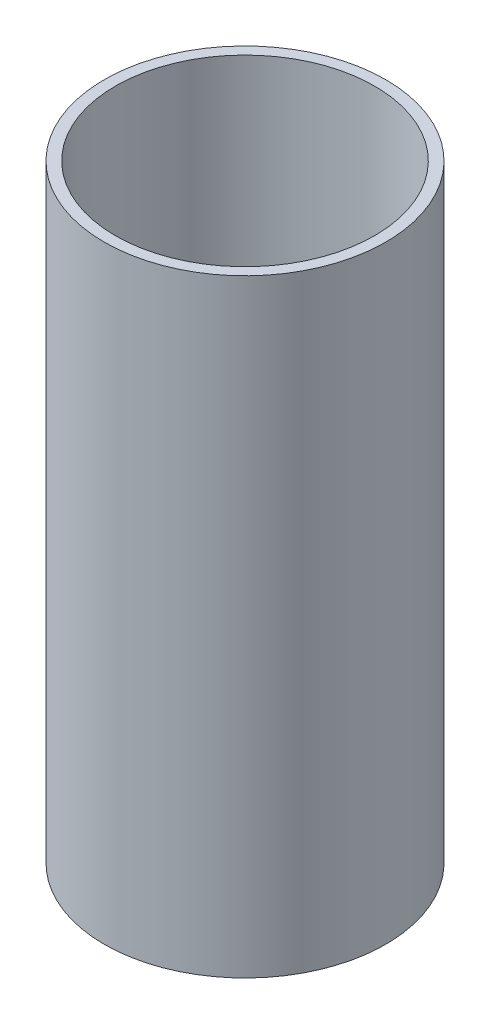
ISO-10303-21;
HEADER;
FILE_DESCRIPTION(('STEP AP214'),'2;1');
FILE_NAME('part.step','',(''),(''),'','','');
FILE_SCHEMA(('AUTOMOTIVE_DESIGN { 1 0 10303 214 1 1 1 1 }'));
ENDSEC;
DATA;
#1=APPLICATION_CONTEXT('core data for automotive mechanical design processes');
#2=APPLICATION_PROTOCOL_DEFINITION('international standard','automotive_design',2000,#1);
#3=PRODUCT_CONTEXT('',#1,'mechanical');
#4=PRODUCT('Part','Part','',(#3));
#5=PRODUCT_RELATED_PRODUCT_CATEGORY('part','',(#4));
#6=PRODUCT_DEFINITION_FORMATION('','',#4);
#7=PRODUCT_DEFINITION_CONTEXT('part definition',#1,'design');
#8=PRODUCT_DEFINITION('design','',#6,#7);
#9=PRODUCT_DEFINITION_SHAPE('','',#8);
#10=(LENGTH_UNIT() NAMED_UNIT(*) SI_UNIT(.MILLI.,.METRE.));
#11=(NAMED_UNIT(*) PLANE_ANGLE_UNIT() SI_UNIT($,.RADIAN.));
#12=(NAMED_UNIT(*) SI_UNIT($,.STERADIAN.) SOLID_ANGLE_UNIT());
#13=UNCERTAINTY_MEASURE_WITH_UNIT(LENGTH_MEASURE(1.E-05),#10,'distance_accuracy_value','');
#14=(GEOMETRIC_REPRESENTATION_CONTEXT(3) GLOBAL_UNCERTAINTY_ASSIGNED_CONTEXT((#13)) GLOBAL_UNIT_ASSIGNED_CONTEXT((#10,
#11,#12)) REPRESENTATION_CONTEXT('',''));
#15=CARTESIAN_POINT('',(0.,0.,0.));
#16=DIRECTION('',(0.,0.,1.));
#17=DIRECTION('',(1.,0.,0.));
#18=AXIS2_PLACEMENT_3D('',#15,#16,#17);
#19=CARTESIAN_POINT('',(0.,80.1,0.));
#20=DIRECTION('',(0.,1.,0.));
#21=DIRECTION('',(0.,0.,1.));
#22=AXIS2_PLACEMENT_3D('',#19,#20,#21);
#23=PLANE('',#22);
#24=CARTESIAN_POINT('',(0.,80.1,0.));
#25=DIRECTION('',(0.,1.,0.));
#26=DIRECTION('',(0.,0.,1.));
#27=AXIS2_PLACEMENT_3D('',#24,#25,#26);
#28=CIRCLE('',#27,19.);
#29=CARTESIAN_POINT('',(0.,80.1,19.));
#30=VERTEX_POINT('',#29);
#31=EDGE_CURVE('E10',#30,#30,#28,.T.);
#32=ORIENTED_EDGE('',*,*,#31,.T.);
#33=EDGE_LOOP('',(#32));
#34=FACE_BOUND('',#33,.T.);
#35=CARTESIAN_POINT('',(0.,80.1,0.));
#36=DIRECTION('',(0.,1.,0.));
#37=DIRECTION('',(0.,0.,1.));
#38=AXIS2_PLACEMENT_3D('',#35,#36,#37);
#39=CIRCLE('',#38,17.5);
#40=CARTESIAN_POINT('',(0.,80.1,17.5));
#41=VERTEX_POINT('',#40);
#42=EDGE_CURVE('E44',#41,#41,#39,.T.);
#43=ORIENTED_EDGE('',*,*,#42,.F.);
#44=EDGE_LOOP('',(#43));
#45=FACE_BOUND('',#44,.T.);
#46=ADVANCED_FACE('F37',(#34,#45),#23,.T.);
#47=CARTESIAN_POINT('',(0.,80.1,0.));
#48=DIRECTION('',(0.,-1.,0.));
#49=DIRECTION('',(0.,0.,-1.));
#50=AXIS2_PLACEMENT_3D('',#47,#48,#49);
#51=CYLINDRICAL_SURFACE('',#50,19.);
#52=ORIENTED_EDGE('',*,*,#31,.F.);
#53=EDGE_LOOP('',(#52));
#54=FACE_BOUND('',#53,.T.);
#55=CARTESIAN_POINT('',(0.,-2.,0.));
#56=DIRECTION('',(0.,1.,0.));
#57=DIRECTION('',(0.,0.,1.));
#58=AXIS2_PLACEMENT_3D('',#55,#56,#57);
#59=CIRCLE('',#58,19.);
#60=CARTESIAN_POINT('',(0.,-2.,19.));
#61=VERTEX_POINT('',#60);
#62=EDGE_CURVE('E53',#61,#61,#59,.T.);
#63=ORIENTED_EDGE('',*,*,#62,.T.);
#64=EDGE_LOOP('',(#63));
#65=FACE_BOUND('',#64,.T.);
#66=ADVANCED_FACE('F39',(#54,#65),#51,.T.);
#67=CARTESIAN_POINT('',(0.,80.1,0.));
#68=DIRECTION('',(0.,-1.,0.));
#69=DIRECTION('',(0.,0.,-1.));
#70=AXIS2_PLACEMENT_3D('',#67,#68,#69);
#71=CYLINDRICAL_SURFACE('',#70,17.5);
#72=ORIENTED_EDGE('',*,*,#42,.T.);
#73=EDGE_LOOP('',(#72));
#74=FACE_BOUND('',#73,.T.);
#75=CARTESIAN_POINT('',(0.,0.,0.));
#76=DIRECTION('',(0.,1.,0.));
#77=DIRECTION('',(0.,0.,1.));
#78=AXIS2_PLACEMENT_3D('',#75,#76,#77);
#79=CIRCLE('',#78,17.5);
#80=CARTESIAN_POINT('',(0.,0.,17.5));
#81=VERTEX_POINT('',#80);
#82=EDGE_CURVE('E48',#81,#81,#79,.T.);
#83=ORIENTED_EDGE('',*,*,#82,.F.);
#84=EDGE_LOOP('',(#83));
#85=FACE_BOUND('',#84,.T.);
#86=ADVANCED_FACE('F66',(#74,#85),#71,.F.);
#87=CARTESIAN_POINT('',(0.,0.,0.));
#88=DIRECTION('',(0.,1.,0.));
#89=DIRECTION('',(0.,0.,1.));
#90=AXIS2_PLACEMENT_3D('',#87,#88,#89);
#91=PLANE('',#90);
#92=ORIENTED_EDGE('',*,*,#82,.T.);
#93=EDGE_LOOP('',(#92));
#94=FACE_BOUND('',#93,.T.);
#95=ADVANCED_FACE('F61',(#94),#91,.T.);
#96=CARTESIAN_POINT('',(0.,-2.,0.));
#97=DIRECTION('',(0.,1.,0.));
#98=DIRECTION('',(0.,0.,1.));
#99=AXIS2_PLACEMENT_3D('',#96,#97,#98);
#100=PLANE('',#99);
#101=ORIENTED_EDGE('',*,*,#62,.F.);
#102=EDGE_LOOP('',(#101));
#103=FACE_BOUND('',#102,.T.);
#104=ADVANCED_FACE('F59',(#103),#100,.F.);
#105=CLOSED_SHELL('',(#46,#66,#86,#95,#104));
#106=MANIFOLD_SOLID_BREP('B2',#105);
#107=ADVANCED_BREP_SHAPE_REPRESENTATION('',(#18,#106),#14);
#108=SHAPE_DEFINITION_REPRESENTATION(#9,#107);
ENDSEC;
END-ISO-10303-21;
